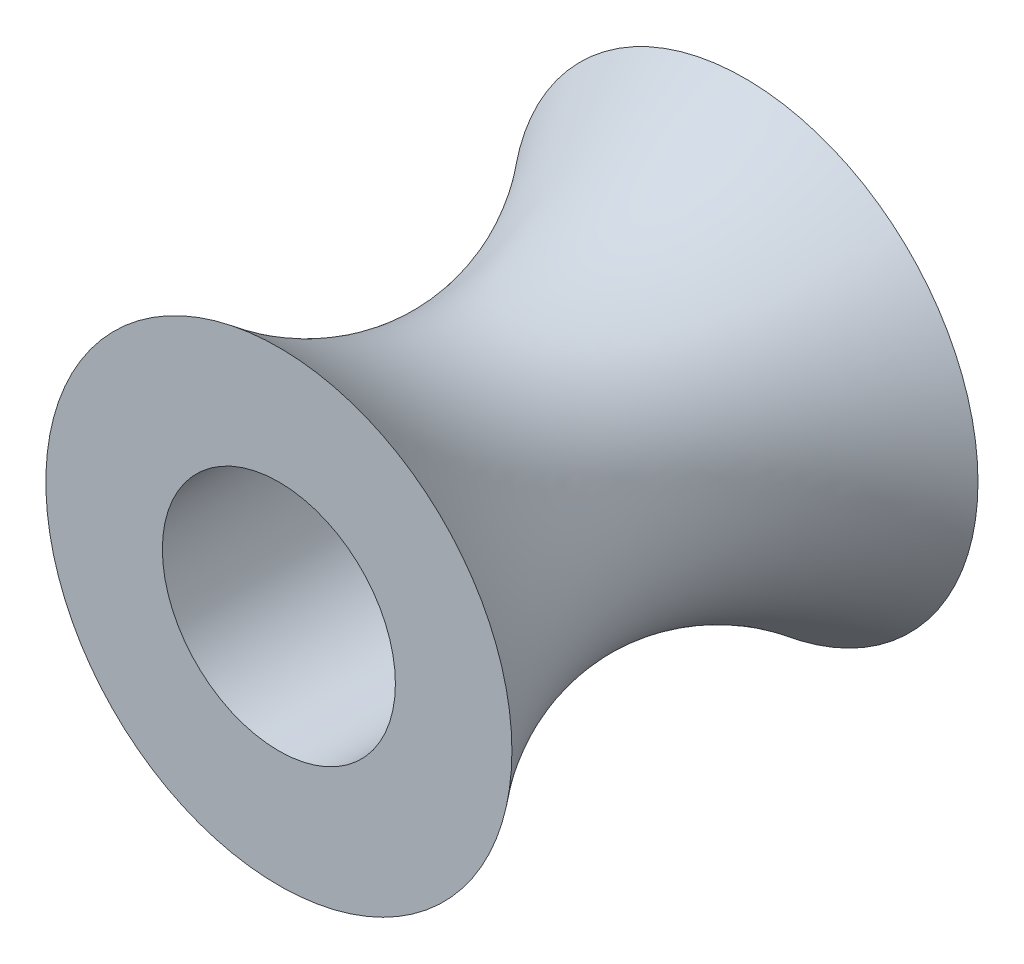
ISO-10303-21;
HEADER;
FILE_DESCRIPTION(('STEP AP214'),'2;1');
FILE_NAME('part.step','',(''),(''),'','','');
FILE_SCHEMA(('AUTOMOTIVE_DESIGN { 1 0 10303 214 1 1 1 1 }'));
ENDSEC;
DATA;
#1=APPLICATION_CONTEXT('core data for automotive mechanical design processes');
#2=APPLICATION_PROTOCOL_DEFINITION('international standard','automotive_design',2000,#1);
#3=PRODUCT_CONTEXT('',#1,'mechanical');
#4=PRODUCT('Part','Part','',(#3));
#5=PRODUCT_RELATED_PRODUCT_CATEGORY('part','',(#4));
#6=PRODUCT_DEFINITION_FORMATION('','',#4);
#7=PRODUCT_DEFINITION_CONTEXT('part definition',#1,'design');
#8=PRODUCT_DEFINITION('design','',#6,#7);
#9=PRODUCT_DEFINITION_SHAPE('','',#8);
#10=(LENGTH_UNIT() NAMED_UNIT(*) SI_UNIT(.MILLI.,.METRE.));
#11=(NAMED_UNIT(*) PLANE_ANGLE_UNIT() SI_UNIT($,.RADIAN.));
#12=(NAMED_UNIT(*) SI_UNIT($,.STERADIAN.) SOLID_ANGLE_UNIT());
#13=UNCERTAINTY_MEASURE_WITH_UNIT(LENGTH_MEASURE(1.E-05),#10,'distance_accuracy_value','');
#14=(GEOMETRIC_REPRESENTATION_CONTEXT(3) GLOBAL_UNCERTAINTY_ASSIGNED_CONTEXT((#13)) GLOBAL_UNIT_ASSIGNED_CONTEXT((#10,
#11,#12)) REPRESENTATION_CONTEXT('',''));
#15=CARTESIAN_POINT('',(0.,0.,0.));
#16=DIRECTION('',(0.,0.,1.));
#17=DIRECTION('',(1.,0.,0.));
#18=AXIS2_PLACEMENT_3D('',#15,#16,#17);
#19=CARTESIAN_POINT('',(0.,0.,10.));
#20=DIRECTION('',(0.,0.,1.));
#21=DIRECTION('',(1.,0.,0.));
#22=AXIS2_PLACEMENT_3D('',#19,#20,#21);
#23=PLANE('',#22);
#24=CARTESIAN_POINT('',(0.,0.,10.));
#25=DIRECTION('',(0.,0.,1.));
#26=DIRECTION('',(1.,0.,0.));
#27=AXIS2_PLACEMENT_3D('',#24,#25,#26);
#28=CIRCLE('',#27,2.5);
#29=CARTESIAN_POINT('',(2.5,0.,10.));
#30=VERTEX_POINT('',#29);
#31=EDGE_CURVE('E46',#30,#30,#28,.T.);
#32=ORIENTED_EDGE('',*,*,#31,.F.);
#33=EDGE_LOOP('',(#32));
#34=FACE_BOUND('',#33,.T.);
#35=CARTESIAN_POINT('',(0.,0.,10.));
#36=DIRECTION('',(0.,0.,1.));
#37=DIRECTION('',(1.,0.,0.));
#38=AXIS2_PLACEMENT_3D('',#35,#36,#37);
#39=CIRCLE('',#38,5.);
#40=CARTESIAN_POINT('',(5.,0.,10.));
#41=VERTEX_POINT('',#40);
#42=EDGE_CURVE('E10',#41,#41,#39,.T.);
#43=ORIENTED_EDGE('',*,*,#42,.T.);
#44=EDGE_LOOP('',(#43));
#45=FACE_BOUND('',#44,.T.);
#46=ADVANCED_FACE('F31',(#34,#45),#23,.T.);
#47=CARTESIAN_POINT('',(0.,5.,10.));
#48=CARTESIAN_POINT('',(0.,0.999551107872599,4.98304718263866));
#49=CARTESIAN_POINT('',(0.,5.,0.));
#50=B_SPLINE_CURVE_WITH_KNOTS('',2,(#47,#48,#49),.UNSPECIFIED.,.F.,.F.,(3,3),(0.,1.),.UNSPECIFIED.);
#51=CARTESIAN_POINT('',(0.,0.,13.9702651167423));
#52=DIRECTION('',(0.,0.,1.));
#53=AXIS1_PLACEMENT('',#51,#52);
#54=SURFACE_OF_REVOLUTION('',#50,#53);
#55=CARTESIAN_POINT('',(0.,0.,0.));
#56=DIRECTION('',(0.,0.,1.));
#57=DIRECTION('',(1.,0.,0.));
#58=AXIS2_PLACEMENT_3D('',#55,#56,#57);
#59=CIRCLE('',#58,5.);
#60=CARTESIAN_POINT('',(5.,0.,0.));
#61=VERTEX_POINT('',#60);
#62=EDGE_CURVE('E38',#61,#61,#59,.T.);
#63=ORIENTED_EDGE('',*,*,#62,.T.);
#64=EDGE_LOOP('',(#63));
#65=FACE_BOUND('',#64,.T.);
#66=ORIENTED_EDGE('',*,*,#42,.F.);
#67=EDGE_LOOP('',(#66));
#68=FACE_BOUND('',#67,.T.);
#69=ADVANCED_FACE('F57',(#65,#68),#54,.F.);
#70=CARTESIAN_POINT('',(0.,0.,0.));
#71=DIRECTION('',(0.,0.,1.));
#72=DIRECTION('',(1.,0.,0.));
#73=AXIS2_PLACEMENT_3D('',#70,#71,#72);
#74=PLANE('',#73);
#75=CARTESIAN_POINT('',(0.,0.,0.));
#76=DIRECTION('',(0.,0.,1.));
#77=DIRECTION('',(1.,0.,0.));
#78=AXIS2_PLACEMENT_3D('',#75,#76,#77);
#79=CIRCLE('',#78,2.5);
#80=CARTESIAN_POINT('',(2.5,0.,0.));
#81=VERTEX_POINT('',#80);
#82=EDGE_CURVE('E42',#81,#81,#79,.T.);
#83=ORIENTED_EDGE('',*,*,#82,.T.);
#84=EDGE_LOOP('',(#83));
#85=FACE_BOUND('',#84,.T.);
#86=ORIENTED_EDGE('',*,*,#62,.F.);
#87=EDGE_LOOP('',(#86));
#88=FACE_BOUND('',#87,.T.);
#89=ADVANCED_FACE('F33',(#85,#88),#74,.F.);
#90=CARTESIAN_POINT('',(0.,0.,0.));
#91=DIRECTION('',(0.,0.,1.));
#92=DIRECTION('',(1.,0.,0.));
#93=AXIS2_PLACEMENT_3D('',#90,#91,#92);
#94=CYLINDRICAL_SURFACE('',#93,2.5);
#95=ORIENTED_EDGE('',*,*,#82,.F.);
#96=EDGE_LOOP('',(#95));
#97=FACE_BOUND('',#96,.T.);
#98=ORIENTED_EDGE('',*,*,#31,.T.);
#99=EDGE_LOOP('',(#98));
#100=FACE_BOUND('',#99,.T.);
#101=ADVANCED_FACE('F60',(#97,#100),#94,.F.);
#102=CLOSED_SHELL('',(#46,#69,#89,#101));
#103=MANIFOLD_SOLID_BREP('B2',#102);
#104=ADVANCED_BREP_SHAPE_REPRESENTATION('',(#18,#103),#14);
#105=SHAPE_DEFINITION_REPRESENTATION(#9,#104);
ENDSEC;
END-ISO-10303-21;
